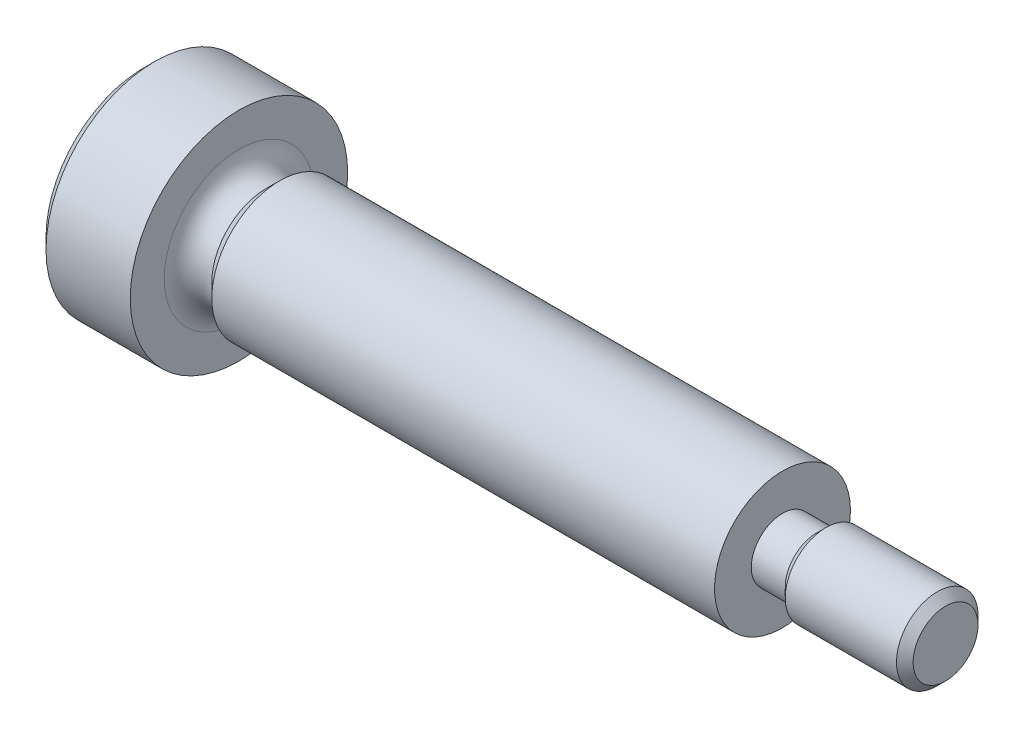
ISO-10303-21;
HEADER;
FILE_DESCRIPTION(('STEP AP214'),'2;1');
FILE_NAME('part.step','',(''),(''),'','','');
FILE_SCHEMA(('AUTOMOTIVE_DESIGN { 1 0 10303 214 1 1 1 1 }'));
ENDSEC;
DATA;
#1=APPLICATION_CONTEXT('core data for automotive mechanical design processes');
#2=APPLICATION_PROTOCOL_DEFINITION('international standard','automotive_design',2000,#1);
#3=PRODUCT_CONTEXT('',#1,'mechanical');
#4=PRODUCT('Part','Part','',(#3));
#5=PRODUCT_RELATED_PRODUCT_CATEGORY('part','',(#4));
#6=PRODUCT_DEFINITION_FORMATION('','',#4);
#7=PRODUCT_DEFINITION_CONTEXT('part definition',#1,'design');
#8=PRODUCT_DEFINITION('design','',#6,#7);
#9=PRODUCT_DEFINITION_SHAPE('','',#8);
#10=(LENGTH_UNIT() NAMED_UNIT(*) SI_UNIT(.MILLI.,.METRE.));
#11=(NAMED_UNIT(*) PLANE_ANGLE_UNIT() SI_UNIT($,.RADIAN.));
#12=(NAMED_UNIT(*) SI_UNIT($,.STERADIAN.) SOLID_ANGLE_UNIT());
#13=UNCERTAINTY_MEASURE_WITH_UNIT(LENGTH_MEASURE(1.E-05),#10,'distance_accuracy_value','');
#14=(GEOMETRIC_REPRESENTATION_CONTEXT(3) GLOBAL_UNCERTAINTY_ASSIGNED_CONTEXT((#13)) GLOBAL_UNIT_ASSIGNED_CONTEXT((#10,
#11,#12)) REPRESENTATION_CONTEXT('',''));
#15=CARTESIAN_POINT('',(0.,0.,0.));
#16=DIRECTION('',(0.,0.,1.));
#17=DIRECTION('',(1.,0.,0.));
#18=AXIS2_PLACEMENT_3D('',#15,#16,#17);
#19=CARTESIAN_POINT('',(-1.9,0.,0.));
#20=DIRECTION('',(-1.,0.,0.));
#21=DIRECTION('',(0.,0.,1.));
#22=AXIS2_PLACEMENT_3D('',#19,#20,#21);
#23=PLANE('',#22);
#24=DIRECTION('',(0.,-1.,0.));
#25=VECTOR('',#24,1.);
#26=CARTESIAN_POINT('',(-1.9,0.721687836487032,-1.25));
#27=LINE('',#26,#25);
#28=CARTESIAN_POINT('',(-1.9,0.721687836487032,-1.25));
#29=VERTEX_POINT('',#28);
#30=CARTESIAN_POINT('',(-1.90000000000107,0.,-1.25));
#31=VERTEX_POINT('',#30);
#32=EDGE_CURVE('E315',#29,#31,#27,.T.);
#33=ORIENTED_EDGE('',*,*,#32,.T.);
#34=CARTESIAN_POINT('',(-1.90000000000107,0.,0.));
#35=DIRECTION('',(1.,0.,0.));
#36=DIRECTION('',(0.,0.,-1.));
#37=AXIS2_PLACEMENT_3D('',#34,#35,#36);
#38=CIRCLE('',#37,1.24999999999942);
#39=CARTESIAN_POINT('',(-1.90000000000107,1.08253175473005,-0.624999999999707));
#40=VERTEX_POINT('',#39);
#41=EDGE_CURVE('E47',#31,#40,#38,.T.);
#42=ORIENTED_EDGE('',*,*,#41,.T.);
#43=DIRECTION('',(0.,-0.499999999999998,-0.86602540378444));
#44=VECTOR('',#43,1.);
#45=CARTESIAN_POINT('',(-1.9,1.44337567297406,0.));
#46=LINE('',#45,#44);
#47=EDGE_CURVE('E319',#40,#29,#46,.T.);
#48=ORIENTED_EDGE('',*,*,#47,.T.);
#49=EDGE_LOOP('',(#33,#42,#48));
#50=FACE_BOUND('',#49,.T.);
#51=ADVANCED_FACE('F32',(#50),#23,.T.);
#52=CARTESIAN_POINT('',(-1.9,1.44337567297406,0.));
#53=VERTEX_POINT('',#52);
#54=EDGE_CURVE('E318',#53,#40,#46,.T.);
#55=ORIENTED_EDGE('',*,*,#54,.T.);
#56=CARTESIAN_POINT('',(-1.90000000000107,1.08253175473005,0.624999999999707));
#57=VERTEX_POINT('',#56);
#58=EDGE_CURVE('E218',#40,#57,#38,.T.);
#59=ORIENTED_EDGE('',*,*,#58,.T.);
#60=DIRECTION('',(0.,0.499999999999999,-0.866025403784439));
#61=VECTOR('',#60,1.);
#62=CARTESIAN_POINT('',(-1.9,0.721687836487031,1.25));
#63=LINE('',#62,#61);
#64=EDGE_CURVE('E248',#57,#53,#63,.T.);
#65=ORIENTED_EDGE('',*,*,#64,.T.);
#66=EDGE_LOOP('',(#55,#59,#65));
#67=FACE_BOUND('',#66,.T.);
#68=ADVANCED_FACE('F119',(#67),#23,.T.);
#69=CARTESIAN_POINT('',(-1.9,0.721687836487031,1.25));
#70=VERTEX_POINT('',#69);
#71=EDGE_CURVE('E320',#70,#57,#63,.T.);
#72=ORIENTED_EDGE('',*,*,#71,.T.);
#73=CARTESIAN_POINT('',(-1.90000000000107,0.,1.24999999999942));
#74=VERTEX_POINT('',#73);
#75=EDGE_CURVE('E221',#57,#74,#38,.T.);
#76=ORIENTED_EDGE('',*,*,#75,.T.);
#77=DIRECTION('',(0.,1.,0.));
#78=VECTOR('',#77,1.);
#79=CARTESIAN_POINT('',(-1.9,-0.721687836487032,1.25));
#80=LINE('',#79,#78);
#81=EDGE_CURVE('E297',#74,#70,#80,.T.);
#82=ORIENTED_EDGE('',*,*,#81,.T.);
#83=EDGE_LOOP('',(#72,#76,#82));
#84=FACE_BOUND('',#83,.T.);
#85=ADVANCED_FACE('F124',(#84),#23,.T.);
#86=CARTESIAN_POINT('',(-1.9,-0.721687836487032,1.25));
#87=VERTEX_POINT('',#86);
#88=EDGE_CURVE('E234',#87,#74,#80,.T.);
#89=ORIENTED_EDGE('',*,*,#88,.T.);
#90=CARTESIAN_POINT('',(-1.90000000000107,-1.08253175473005,0.624999999999708));
#91=VERTEX_POINT('',#90);
#92=EDGE_CURVE('E225',#74,#91,#38,.T.);
#93=ORIENTED_EDGE('',*,*,#92,.T.);
#94=DIRECTION('',(0.,0.499999999999999,0.866025403784439));
#95=VECTOR('',#94,1.);
#96=CARTESIAN_POINT('',(-1.9,-1.44337567297406,0.));
#97=LINE('',#96,#95);
#98=EDGE_CURVE('E307',#91,#87,#97,.T.);
#99=ORIENTED_EDGE('',*,*,#98,.T.);
#100=EDGE_LOOP('',(#89,#93,#99));
#101=FACE_BOUND('',#100,.T.);
#102=ADVANCED_FACE('F199',(#101),#23,.T.);
#103=CARTESIAN_POINT('',(-1.9,-1.44337567297406,0.));
#104=VERTEX_POINT('',#103);
#105=EDGE_CURVE('E301',#104,#91,#97,.T.);
#106=ORIENTED_EDGE('',*,*,#105,.T.);
#107=CARTESIAN_POINT('',(-1.90000000000107,-1.08253175473005,-0.624999999999708));
#108=VERTEX_POINT('',#107);
#109=EDGE_CURVE('E211',#91,#108,#38,.T.);
#110=ORIENTED_EDGE('',*,*,#109,.T.);
#111=DIRECTION('',(0.,-0.499999999999999,0.866025403784439));
#112=VECTOR('',#111,1.);
#113=CARTESIAN_POINT('',(-1.9,-0.721687836487031,-1.25));
#114=LINE('',#113,#112);
#115=EDGE_CURVE('E314',#108,#104,#114,.T.);
#116=ORIENTED_EDGE('',*,*,#115,.T.);
#117=EDGE_LOOP('',(#106,#110,#116));
#118=FACE_BOUND('',#117,.T.);
#119=ADVANCED_FACE('F117',(#118),#23,.T.);
#120=CARTESIAN_POINT('',(0.815694337324253,0.,0.));
#121=DIRECTION('',(-1.,0.,0.));
#122=DIRECTION('',(0.,0.,1.));
#123=AXIS2_PLACEMENT_3D('',#120,#121,#122);
#124=TOROIDAL_SURFACE('',#123,2.79617085728958,0.817000000020676);
#125=CARTESIAN_POINT('',(0.998999999978878,0.,0.));
#126=DIRECTION('',(1.,0.,0.));
#127=DIRECTION('',(0.,0.,-1.));
#128=AXIS2_PLACEMENT_3D('',#125,#126,#127);
#129=CIRCLE('',#128,1.99999999995271);
#130=CARTESIAN_POINT('',(0.998999999978878,0.,-1.99999999995271));
#131=VERTEX_POINT('',#130);
#132=EDGE_CURVE('E204',#131,#131,#129,.T.);
#133=ORIENTED_EDGE('',*,*,#132,.F.);
#134=EDGE_LOOP('',(#133));
#135=FACE_BOUND('',#134,.T.);
#136=CARTESIAN_POINT('',(-1.6004125108493E-11,0.,0.));
#137=DIRECTION('',(-1.,0.,0.));
#138=DIRECTION('',(0.,0.,1.));
#139=AXIS2_PLACEMENT_3D('',#136,#137,#138);
#140=CIRCLE('',#139,2.74999999997868);
#141=CARTESIAN_POINT('',(-1.6004125108493E-11,0.,2.74999999997868));
#142=VERTEX_POINT('',#141);
#143=EDGE_CURVE('E207',#142,#142,#140,.T.);
#144=ORIENTED_EDGE('',*,*,#143,.F.);
#145=EDGE_LOOP('',(#144));
#146=FACE_BOUND('',#145,.T.);
#147=ADVANCED_FACE('F192',(#135,#146),#124,.F.);
#148=CARTESIAN_POINT('',(-1.60040485680681E-11,3.99999999997868,0.));
#149=DIRECTION('',(1.,0.,0.));
#150=DIRECTION('',(0.,0.,-1.));
#151=AXIS2_PLACEMENT_3D('',#148,#149,#150);
#152=PLANE('',#151);
#153=ORIENTED_EDGE('',*,*,#143,.T.);
#154=EDGE_LOOP('',(#153));
#155=FACE_BOUND('',#154,.T.);
#156=CARTESIAN_POINT('',(-1.60039082680585E-11,0.,0.));
#157=DIRECTION('',(-1.,0.,0.));
#158=DIRECTION('',(0.,0.,1.));
#159=AXIS2_PLACEMENT_3D('',#156,#157,#158);
#160=CIRCLE('',#159,3.99999999997868);
#161=CARTESIAN_POINT('',(-1.60039082680585E-11,0.,3.99999999997868));
#162=VERTEX_POINT('',#161);
#163=EDGE_CURVE('E209',#162,#162,#160,.T.);
#164=ORIENTED_EDGE('',*,*,#163,.F.);
#165=EDGE_LOOP('',(#164));
#166=FACE_BOUND('',#165,.T.);
#167=ADVANCED_FACE('F189',(#155,#166),#152,.T.);
#168=CARTESIAN_POINT('',(0.998999999978878,0.,0.));
#169=DIRECTION('',(-1.,0.,0.));
#170=DIRECTION('',(0.,0.,1.));
#171=AXIS2_PLACEMENT_3D('',#168,#169,#170);
#172=CYLINDRICAL_SURFACE('',#171,3.99999999997868);
#173=CARTESIAN_POINT('',(-3.09999999995902,0.,0.));
#174=DIRECTION('',(-1.,0.,0.));
#175=DIRECTION('',(0.,0.,1.));
#176=AXIS2_PLACEMENT_3D('',#173,#174,#175);
#177=CIRCLE('',#176,3.99999999997868);
#178=CARTESIAN_POINT('',(-3.09999999995902,0.,3.99999999997868));
#179=VERTEX_POINT('',#178);
#180=EDGE_CURVE('E11',#179,#179,#177,.F.);
#181=ORIENTED_EDGE('',*,*,#180,.T.);
#182=EDGE_LOOP('',(#181));
#183=FACE_BOUND('',#182,.T.);
#184=ORIENTED_EDGE('',*,*,#163,.T.);
#185=EDGE_LOOP('',(#184));
#186=FACE_BOUND('',#185,.T.);
#187=ADVANCED_FACE('F185',(#183,#186),#172,.T.);
#188=CARTESIAN_POINT('',(-3.5,0.,0.));
#189=DIRECTION('',(-1.,0.,0.));
#190=DIRECTION('',(0.,0.,1.));
#191=AXIS2_PLACEMENT_3D('',#188,#189,#190);
#192=PLANE('',#191);
#193=CARTESIAN_POINT('',(-3.5,0.,0.));
#194=DIRECTION('',(-1.,0.,0.));
#195=DIRECTION('',(0.,0.,1.));
#196=AXIS2_PLACEMENT_3D('',#193,#194,#195);
#197=CIRCLE('',#196,3.59999999993771);
#198=CARTESIAN_POINT('',(-3.5,0.,3.59999999993771));
#199=VERTEX_POINT('',#198);
#200=EDGE_CURVE('E40',#199,#199,#197,.T.);
#201=ORIENTED_EDGE('',*,*,#200,.T.);
#202=EDGE_LOOP('',(#201));
#203=FACE_BOUND('',#202,.T.);
#204=DIRECTION('',(0.,0.499999999999999,-0.866025403784439));
#205=VECTOR('',#204,1.);
#206=CARTESIAN_POINT('',(-3.5,0.721687836487031,1.25));
#207=LINE('',#206,#205);
#208=CARTESIAN_POINT('',(-3.5,0.721687836487031,1.25));
#209=VERTEX_POINT('',#208);
#210=CARTESIAN_POINT('',(-3.5,1.44337567297406,0.));
#211=VERTEX_POINT('',#210);
#212=EDGE_CURVE('E55',#209,#211,#207,.T.);
#213=ORIENTED_EDGE('',*,*,#212,.F.);
#214=DIRECTION('',(0.,1.,0.));
#215=VECTOR('',#214,1.);
#216=CARTESIAN_POINT('',(-3.5,-0.721687836487032,1.25));
#217=LINE('',#216,#215);
#218=CARTESIAN_POINT('',(-3.5,-0.721687836487032,1.25));
#219=VERTEX_POINT('',#218);
#220=EDGE_CURVE('E245',#219,#209,#217,.T.);
#221=ORIENTED_EDGE('',*,*,#220,.F.);
#222=DIRECTION('',(0.,0.499999999999999,0.866025403784439));
#223=VECTOR('',#222,1.);
#224=CARTESIAN_POINT('',(-3.5,-1.44337567297406,0.));
#225=LINE('',#224,#223);
#226=CARTESIAN_POINT('',(-3.5,-1.44337567297406,0.));
#227=VERTEX_POINT('',#226);
#228=EDGE_CURVE('E242',#227,#219,#225,.T.);
#229=ORIENTED_EDGE('',*,*,#228,.F.);
#230=DIRECTION('',(0.,-0.499999999999999,0.866025403784439));
#231=VECTOR('',#230,1.);
#232=CARTESIAN_POINT('',(-3.5,-0.721687836487031,-1.25));
#233=LINE('',#232,#231);
#234=CARTESIAN_POINT('',(-3.5,-0.721687836487031,-1.25));
#235=VERTEX_POINT('',#234);
#236=EDGE_CURVE('E239',#235,#227,#233,.T.);
#237=ORIENTED_EDGE('',*,*,#236,.F.);
#238=DIRECTION('',(0.,-1.,0.));
#239=VECTOR('',#238,1.);
#240=CARTESIAN_POINT('',(-3.5,0.721687836487032,-1.25));
#241=LINE('',#240,#239);
#242=CARTESIAN_POINT('',(-3.5,0.721687836487032,-1.25));
#243=VERTEX_POINT('',#242);
#244=EDGE_CURVE('E231',#243,#235,#241,.T.);
#245=ORIENTED_EDGE('',*,*,#244,.F.);
#246=DIRECTION('',(0.,-0.499999999999998,-0.86602540378444));
#247=VECTOR('',#246,1.);
#248=CARTESIAN_POINT('',(-3.5,1.44337567297406,0.));
#249=LINE('',#248,#247);
#250=EDGE_CURVE('E228',#211,#243,#249,.T.);
#251=ORIENTED_EDGE('',*,*,#250,.F.);
#252=EDGE_LOOP('',(#213,#221,#229,#237,#245,#251));
#253=FACE_BOUND('',#252,.T.);
#254=ADVANCED_FACE('F181',(#203,#253),#192,.T.);
#255=CARTESIAN_POINT('',(0.998999999978878,0.,0.));
#256=DIRECTION('',(1.,0.,0.));
#257=DIRECTION('',(0.,0.,-1.));
#258=AXIS2_PLACEMENT_3D('',#255,#256,#257);
#259=CONICAL_SURFACE('',#258,1.99999999995271,0.785398163397452);
#260=CARTESIAN_POINT('',(1.499,0.,0.));
#261=DIRECTION('',(1.,0.,0.));
#262=DIRECTION('',(0.,0.,-1.));
#263=AXIS2_PLACEMENT_3D('',#260,#261,#262);
#264=CIRCLE('',#263,2.49999999997383);
#265=CARTESIAN_POINT('',(1.499,0.,-2.49999999997383));
#266=VERTEX_POINT('',#265);
#267=EDGE_CURVE('E214',#266,#266,#264,.T.);
#268=ORIENTED_EDGE('',*,*,#267,.F.);
#269=EDGE_LOOP('',(#268));
#270=FACE_BOUND('',#269,.T.);
#271=ORIENTED_EDGE('',*,*,#132,.T.);
#272=EDGE_LOOP('',(#271));
#273=FACE_BOUND('',#272,.T.);
#274=ADVANCED_FACE('F177',(#270,#273),#259,.T.);
#275=CARTESIAN_POINT('',(20.,0.,0.));
#276=DIRECTION('',(-1.,0.,0.));
#277=DIRECTION('',(0.,0.,1.));
#278=AXIS2_PLACEMENT_3D('',#275,#276,#277);
#279=CYLINDRICAL_SURFACE('',#278,2.5);
#280=CARTESIAN_POINT('',(20.,0.,0.));
#281=DIRECTION('',(1.,0.,0.));
#282=DIRECTION('',(0.,0.,-1.));
#283=AXIS2_PLACEMENT_3D('',#280,#281,#282);
#284=CIRCLE('',#283,2.5);
#285=CARTESIAN_POINT('',(20.,0.,-2.5));
#286=VERTEX_POINT('',#285);
#287=EDGE_CURVE('E274',#286,#286,#284,.T.);
#288=ORIENTED_EDGE('',*,*,#287,.F.);
#289=EDGE_LOOP('',(#288));
#290=FACE_BOUND('',#289,.T.);
#291=ORIENTED_EDGE('',*,*,#267,.T.);
#292=EDGE_LOOP('',(#291));
#293=FACE_BOUND('',#292,.T.);
#294=ADVANCED_FACE('F173',(#290,#293),#279,.T.);
#295=CARTESIAN_POINT('',(20.,0.,0.));
#296=DIRECTION('',(1.,0.,0.));
#297=DIRECTION('',(0.,0.,-1.));
#298=AXIS2_PLACEMENT_3D('',#295,#296,#297);
#299=PLANE('',#298);
#300=CARTESIAN_POINT('',(20.,0.,0.));
#301=DIRECTION('',(1.,0.,0.));
#302=DIRECTION('',(0.,0.,-1.));
#303=AXIS2_PLACEMENT_3D('',#300,#301,#302);
#304=CIRCLE('',#303,1.15);
#305=CARTESIAN_POINT('',(20.,0.,-1.15));
#306=VERTEX_POINT('',#305);
#307=EDGE_CURVE('E270',#306,#306,#304,.T.);
#308=ORIENTED_EDGE('',*,*,#307,.F.);
#309=EDGE_LOOP('',(#308));
#310=FACE_BOUND('',#309,.T.);
#311=ORIENTED_EDGE('',*,*,#287,.T.);
#312=EDGE_LOOP('',(#311));
#313=FACE_BOUND('',#312,.T.);
#314=ADVANCED_FACE('F169',(#310,#313),#299,.T.);
#315=CARTESIAN_POINT('',(21.25,0.,0.));
#316=DIRECTION('',(-1.,0.,0.));
#317=DIRECTION('',(0.,0.,1.));
#318=AXIS2_PLACEMENT_3D('',#315,#316,#317);
#319=CYLINDRICAL_SURFACE('',#318,1.15);
#320=CARTESIAN_POINT('',(21.25,0.,0.));
#321=DIRECTION('',(1.,0.,0.));
#322=DIRECTION('',(0.,0.,-1.));
#323=AXIS2_PLACEMENT_3D('',#320,#321,#322);
#324=CIRCLE('',#323,1.15);
#325=CARTESIAN_POINT('',(21.25,0.,-1.15));
#326=VERTEX_POINT('',#325);
#327=EDGE_CURVE('E271',#326,#326,#324,.T.);
#328=ORIENTED_EDGE('',*,*,#327,.F.);
#329=EDGE_LOOP('',(#328));
#330=FACE_BOUND('',#329,.T.);
#331=ORIENTED_EDGE('',*,*,#307,.T.);
#332=EDGE_LOOP('',(#331));
#333=FACE_BOUND('',#332,.T.);
#334=ADVANCED_FACE('F165',(#330,#333),#319,.T.);
#335=CARTESIAN_POINT('',(21.25,0.,0.));
#336=DIRECTION('',(1.,0.,0.));
#337=DIRECTION('',(0.,0.,-1.));
#338=AXIS2_PLACEMENT_3D('',#335,#336,#337);
#339=CONICAL_SURFACE('',#338,1.15000000004329,0.785398163316247);
#340=CARTESIAN_POINT('',(21.5999999999781,0.,0.));
#341=DIRECTION('',(1.,0.,0.));
#342=DIRECTION('',(0.,0.,-1.));
#343=AXIS2_PLACEMENT_3D('',#340,#341,#342);
#344=CIRCLE('',#343,1.49999999996453);
#345=CARTESIAN_POINT('',(21.5999999999781,0.,-1.49999999996453));
#346=VERTEX_POINT('',#345);
#347=EDGE_CURVE('E267',#346,#346,#344,.T.);
#348=ORIENTED_EDGE('',*,*,#347,.F.);
#349=EDGE_LOOP('',(#348));
#350=FACE_BOUND('',#349,.T.);
#351=ORIENTED_EDGE('',*,*,#327,.T.);
#352=EDGE_LOOP('',(#351));
#353=FACE_BOUND('',#352,.T.);
#354=ADVANCED_FACE('F161',(#350,#353),#339,.T.);
#355=CARTESIAN_POINT('',(25.6935,0.,0.));
#356=DIRECTION('',(-1.,0.,0.));
#357=DIRECTION('',(0.,0.,1.));
#358=AXIS2_PLACEMENT_3D('',#355,#356,#357);
#359=CYLINDRICAL_SURFACE('',#358,1.5);
#360=CARTESIAN_POINT('',(25.6935,0.,0.));
#361=DIRECTION('',(1.,0.,0.));
#362=DIRECTION('',(0.,0.,-1.));
#363=AXIS2_PLACEMENT_3D('',#360,#361,#362);
#364=CIRCLE('',#363,1.5);
#365=CARTESIAN_POINT('',(25.6935,0.,-1.5));
#366=VERTEX_POINT('',#365);
#367=EDGE_CURVE('E264',#366,#366,#364,.T.);
#368=ORIENTED_EDGE('',*,*,#367,.F.);
#369=EDGE_LOOP('',(#368));
#370=FACE_BOUND('',#369,.T.);
#371=ORIENTED_EDGE('',*,*,#347,.T.);
#372=EDGE_LOOP('',(#371));
#373=FACE_BOUND('',#372,.T.);
#374=ADVANCED_FACE('F157',(#370,#373),#359,.T.);
#375=CARTESIAN_POINT('',(25.6935,0.,0.));
#376=DIRECTION('',(-1.,0.,0.));
#377=DIRECTION('',(0.,0.,-1.));
#378=AXIS2_PLACEMENT_3D('',#375,#376,#377);
#379=CONICAL_SURFACE('',#378,1.50000000000986,0.785398163397445);
#380=CARTESIAN_POINT('',(26.,0.,0.));
#381=DIRECTION('',(1.,0.,0.));
#382=DIRECTION('',(0.,0.,-1.));
#383=AXIS2_PLACEMENT_3D('',#380,#381,#382);
#384=CIRCLE('',#383,1.19350000000986);
#385=CARTESIAN_POINT('',(26.,0.,-1.19350000000986));
#386=VERTEX_POINT('',#385);
#387=EDGE_CURVE('E251',#386,#386,#384,.T.);
#388=ORIENTED_EDGE('',*,*,#387,.F.);
#389=EDGE_LOOP('',(#388));
#390=FACE_BOUND('',#389,.T.);
#391=ORIENTED_EDGE('',*,*,#367,.T.);
#392=EDGE_LOOP('',(#391));
#393=FACE_BOUND('',#392,.T.);
#394=ADVANCED_FACE('F153',(#390,#393),#379,.T.);
#395=CARTESIAN_POINT('',(26.,0.,0.));
#396=DIRECTION('',(1.,0.,0.));
#397=DIRECTION('',(0.,0.,-1.));
#398=AXIS2_PLACEMENT_3D('',#395,#396,#397);
#399=PLANE('',#398);
#400=ORIENTED_EDGE('',*,*,#387,.T.);
#401=EDGE_LOOP('',(#400));
#402=FACE_BOUND('',#401,.T.);
#403=ADVANCED_FACE('F150',(#402),#399,.T.);
#404=CARTESIAN_POINT('',(-1.9,0.721687836487031,1.25));
#405=DIRECTION('',(0.,0.866025403784439,0.499999999999999));
#406=DIRECTION('',(0.,-0.499999999999999,0.866025403784439));
#407=AXIS2_PLACEMENT_3D('',#404,#405,#406);
#408=PLANE('',#407);
#409=ORIENTED_EDGE('',*,*,#212,.T.);
#410=DIRECTION('',(-1.,0.,0.));
#411=VECTOR('',#410,1.);
#412=CARTESIAN_POINT('',(-1.9,1.44337567297406,0.));
#413=LINE('',#412,#411);
#414=EDGE_CURVE('E260',#53,#211,#413,.T.);
#415=ORIENTED_EDGE('',*,*,#414,.F.);
#416=ORIENTED_EDGE('',*,*,#64,.F.);
#417=ORIENTED_EDGE('',*,*,#71,.F.);
#418=DIRECTION('',(-1.,0.,0.));
#419=VECTOR('',#418,1.);
#420=CARTESIAN_POINT('',(-1.9,0.721687836487031,1.25));
#421=LINE('',#420,#419);
#422=EDGE_CURVE('E249',#70,#209,#421,.T.);
#423=ORIENTED_EDGE('',*,*,#422,.T.);
#424=EDGE_LOOP('',(#409,#415,#416,#417,#423));
#425=FACE_BOUND('',#424,.T.);
#426=ADVANCED_FACE('F132',(#425),#408,.F.);
#427=CARTESIAN_POINT('',(-1.9,-0.721687836487032,1.25));
#428=DIRECTION('',(0.,0.,1.));
#429=DIRECTION('',(1.,0.,0.));
#430=AXIS2_PLACEMENT_3D('',#427,#428,#429);
#431=PLANE('',#430);
#432=ORIENTED_EDGE('',*,*,#220,.T.);
#433=ORIENTED_EDGE('',*,*,#422,.F.);
#434=ORIENTED_EDGE('',*,*,#81,.F.);
#435=ORIENTED_EDGE('',*,*,#88,.F.);
#436=DIRECTION('',(-1.,0.,0.));
#437=VECTOR('',#436,1.);
#438=CARTESIAN_POINT('',(-1.9,-0.721687836487032,1.25));
#439=LINE('',#438,#437);
#440=EDGE_CURVE('E252',#87,#219,#439,.T.);
#441=ORIENTED_EDGE('',*,*,#440,.T.);
#442=EDGE_LOOP('',(#432,#433,#434,#435,#441));
#443=FACE_BOUND('',#442,.T.);
#444=ADVANCED_FACE('F128',(#443),#431,.F.);
#445=CARTESIAN_POINT('',(-1.9,-1.44337567297406,0.));
#446=DIRECTION('',(0.,-0.866025403784439,0.499999999999999));
#447=DIRECTION('',(0.,-0.499999999999999,-0.866025403784439));
#448=AXIS2_PLACEMENT_3D('',#445,#446,#447);
#449=PLANE('',#448);
#450=ORIENTED_EDGE('',*,*,#228,.T.);
#451=ORIENTED_EDGE('',*,*,#440,.F.);
#452=ORIENTED_EDGE('',*,*,#98,.F.);
#453=ORIENTED_EDGE('',*,*,#105,.F.);
#454=DIRECTION('',(-1.,0.,0.));
#455=VECTOR('',#454,1.);
#456=CARTESIAN_POINT('',(-1.9,-1.44337567297406,0.));
#457=LINE('',#456,#455);
#458=EDGE_CURVE('E254',#104,#227,#457,.T.);
#459=ORIENTED_EDGE('',*,*,#458,.T.);
#460=EDGE_LOOP('',(#450,#451,#452,#453,#459));
#461=FACE_BOUND('',#460,.T.);
#462=ADVANCED_FACE('F131',(#461),#449,.F.);
#463=CARTESIAN_POINT('',(-1.9,-0.721687836487031,-1.25));
#464=DIRECTION('',(0.,-0.866025403784439,-0.499999999999999));
#465=DIRECTION('',(0.,0.499999999999999,-0.866025403784439));
#466=AXIS2_PLACEMENT_3D('',#463,#464,#465);
#467=PLANE('',#466);
#468=ORIENTED_EDGE('',*,*,#236,.T.);
#469=ORIENTED_EDGE('',*,*,#458,.F.);
#470=ORIENTED_EDGE('',*,*,#115,.F.);
#471=CARTESIAN_POINT('',(-1.9,-0.721687836487031,-1.25));
#472=VERTEX_POINT('',#471);
#473=EDGE_CURVE('E310',#472,#108,#114,.T.);
#474=ORIENTED_EDGE('',*,*,#473,.F.);
#475=DIRECTION('',(-1.,0.,0.));
#476=VECTOR('',#475,1.);
#477=CARTESIAN_POINT('',(-1.9,-0.721687836487031,-1.25));
#478=LINE('',#477,#476);
#479=EDGE_CURVE('E256',#472,#235,#478,.T.);
#480=ORIENTED_EDGE('',*,*,#479,.T.);
#481=EDGE_LOOP('',(#468,#469,#470,#474,#480));
#482=FACE_BOUND('',#481,.T.);
#483=ADVANCED_FACE('F136',(#482),#467,.F.);
#484=CARTESIAN_POINT('',(-1.9,0.721687836487032,-1.25));
#485=DIRECTION('',(0.,0.,-1.));
#486=DIRECTION('',(-1.,0.,0.));
#487=AXIS2_PLACEMENT_3D('',#484,#485,#486);
#488=PLANE('',#487);
#489=ORIENTED_EDGE('',*,*,#244,.T.);
#490=ORIENTED_EDGE('',*,*,#479,.F.);
#491=EDGE_CURVE('E317',#31,#472,#27,.T.);
#492=ORIENTED_EDGE('',*,*,#491,.F.);
#493=ORIENTED_EDGE('',*,*,#32,.F.);
#494=DIRECTION('',(-1.,0.,0.));
#495=VECTOR('',#494,1.);
#496=CARTESIAN_POINT('',(-1.9,0.721687836487032,-1.25));
#497=LINE('',#496,#495);
#498=EDGE_CURVE('E258',#29,#243,#497,.T.);
#499=ORIENTED_EDGE('',*,*,#498,.T.);
#500=EDGE_LOOP('',(#489,#490,#492,#493,#499));
#501=FACE_BOUND('',#500,.T.);
#502=ADVANCED_FACE('F140',(#501),#488,.F.);
#503=CARTESIAN_POINT('',(-1.9,1.44337567297406,0.));
#504=DIRECTION('',(0.,0.86602540378444,-0.499999999999998));
#505=DIRECTION('',(0.,0.499999999999998,0.86602540378444));
#506=AXIS2_PLACEMENT_3D('',#503,#504,#505);
#507=PLANE('',#506);
#508=ORIENTED_EDGE('',*,*,#250,.T.);
#509=ORIENTED_EDGE('',*,*,#498,.F.);
#510=ORIENTED_EDGE('',*,*,#47,.F.);
#511=ORIENTED_EDGE('',*,*,#54,.F.);
#512=ORIENTED_EDGE('',*,*,#414,.T.);
#513=EDGE_LOOP('',(#508,#509,#510,#511,#512));
#514=FACE_BOUND('',#513,.T.);
#515=ADVANCED_FACE('F114',(#514),#507,.F.);
#516=ORIENTED_EDGE('',*,*,#473,.T.);
#517=EDGE_CURVE('E208',#108,#31,#38,.T.);
#518=ORIENTED_EDGE('',*,*,#517,.T.);
#519=ORIENTED_EDGE('',*,*,#491,.T.);
#520=EDGE_LOOP('',(#516,#518,#519));
#521=FACE_BOUND('',#520,.T.);
#522=ADVANCED_FACE('F107',(#521),#23,.T.);
#523=CARTESIAN_POINT('',(-1.17831216351438,0.,0.));
#524=DIRECTION('',(-1.,0.,0.));
#525=DIRECTION('',(0.,0.,1.));
#526=AXIS2_PLACEMENT_3D('',#523,#524,#525);
#527=CONICAL_SURFACE('',#526,0.,1.04719755119661);
#528=ORIENTED_EDGE('',*,*,#41,.F.);
#529=ORIENTED_EDGE('',*,*,#517,.F.);
#530=ORIENTED_EDGE('',*,*,#109,.F.);
#531=ORIENTED_EDGE('',*,*,#92,.F.);
#532=ORIENTED_EDGE('',*,*,#75,.F.);
#533=ORIENTED_EDGE('',*,*,#58,.F.);
#534=EDGE_LOOP('',(#528,#529,#530,#531,#532,#533));
#535=FACE_BOUND('',#534,.T.);
#536=CARTESIAN_POINT('',(-1.17831216351438,0.,0.));
#537=VERTEX_POINT('',#536);
#538=VERTEX_LOOP('',#537);
#539=FACE_BOUND('',#538,.T.);
#540=ADVANCED_FACE('F105',(#535,#539),#527,.F.);
#541=CARTESIAN_POINT('',(-3.5,0.,0.));
#542=DIRECTION('',(1.,0.,0.));
#543=DIRECTION('',(0.,0.,-1.));
#544=AXIS2_PLACEMENT_3D('',#541,#542,#543);
#545=CONICAL_SURFACE('',#544,3.59999999993771,0.78539816339744);
#546=ORIENTED_EDGE('',*,*,#180,.F.);
#547=EDGE_LOOP('',(#546));
#548=FACE_BOUND('',#547,.T.);
#549=ORIENTED_EDGE('',*,*,#200,.F.);
#550=EDGE_LOOP('',(#549));
#551=FACE_BOUND('',#550,.T.);
#552=ADVANCED_FACE('F34',(#548,#551),#545,.T.);
#553=CLOSED_SHELL('',(#51,#68,#85,#102,#119,#147,#167,#187,#254,#274,#294,#314,#334,#354,#374,
#394,#403,#426,#444,#462,#483,#502,#515,#522,#540,#552));
#554=MANIFOLD_SOLID_BREP('B2',#553);
#555=ADVANCED_BREP_SHAPE_REPRESENTATION('',(#18,#554),#14);
#556=SHAPE_DEFINITION_REPRESENTATION(#9,#555);
ENDSEC;
END-ISO-10303-21;
